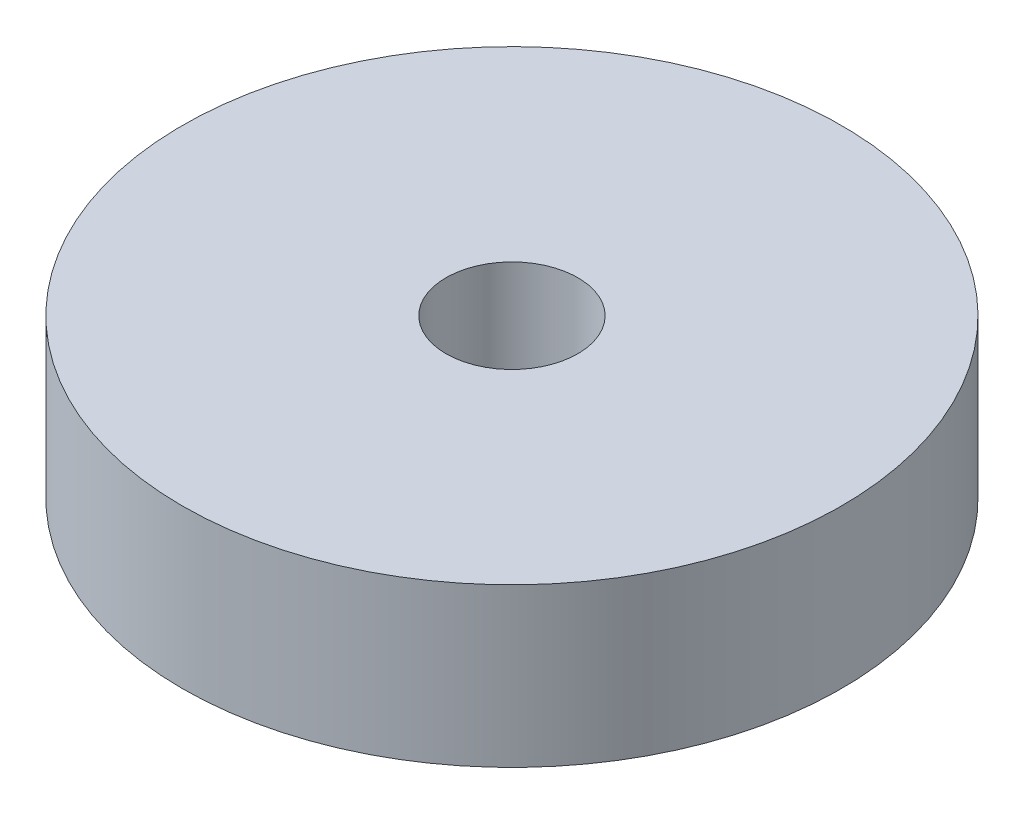
ISO-10303-21;
HEADER;
FILE_DESCRIPTION(('STEP AP214'),'2;1');
FILE_NAME('part.step','',(''),(''),'','','');
FILE_SCHEMA(('AUTOMOTIVE_DESIGN { 1 0 10303 214 1 1 1 1 }'));
ENDSEC;
DATA;
#1=APPLICATION_CONTEXT('core data for automotive mechanical design processes');
#2=APPLICATION_PROTOCOL_DEFINITION('international standard','automotive_design',2000,#1);
#3=PRODUCT_CONTEXT('',#1,'mechanical');
#4=PRODUCT('Part','Part','',(#3));
#5=PRODUCT_RELATED_PRODUCT_CATEGORY('part','',(#4));
#6=PRODUCT_DEFINITION_FORMATION('','',#4);
#7=PRODUCT_DEFINITION_CONTEXT('part definition',#1,'design');
#8=PRODUCT_DEFINITION('design','',#6,#7);
#9=PRODUCT_DEFINITION_SHAPE('','',#8);
#10=(LENGTH_UNIT() NAMED_UNIT(*) SI_UNIT(.MILLI.,.METRE.));
#11=(NAMED_UNIT(*) PLANE_ANGLE_UNIT() SI_UNIT($,.RADIAN.));
#12=(NAMED_UNIT(*) SI_UNIT($,.STERADIAN.) SOLID_ANGLE_UNIT());
#13=UNCERTAINTY_MEASURE_WITH_UNIT(LENGTH_MEASURE(1.E-05),#10,'distance_accuracy_value','');
#14=(GEOMETRIC_REPRESENTATION_CONTEXT(3) GLOBAL_UNCERTAINTY_ASSIGNED_CONTEXT((#13)) GLOBAL_UNIT_ASSIGNED_CONTEXT((#10,
#11,#12)) REPRESENTATION_CONTEXT('',''));
#15=CARTESIAN_POINT('',(0.,0.,0.));
#16=DIRECTION('',(0.,0.,1.));
#17=DIRECTION('',(1.,0.,0.));
#18=AXIS2_PLACEMENT_3D('',#15,#16,#17);
#19=CARTESIAN_POINT('',(0.,6.,0.));
#20=DIRECTION('',(0.,1.,0.));
#21=DIRECTION('',(0.,0.,1.));
#22=AXIS2_PLACEMENT_3D('',#19,#20,#21);
#23=PLANE('',#22);
#24=CARTESIAN_POINT('',(0.,6.,0.));
#25=DIRECTION('',(0.,1.,0.));
#26=DIRECTION('',(0.,0.,1.));
#27=AXIS2_PLACEMENT_3D('',#24,#25,#26);
#28=CIRCLE('',#27,12.5);
#29=CARTESIAN_POINT('',(0.,6.,12.5));
#30=VERTEX_POINT('',#29);
#31=EDGE_CURVE('E10',#30,#30,#28,.T.);
#32=ORIENTED_EDGE('',*,*,#31,.T.);
#33=EDGE_LOOP('',(#32));
#34=FACE_BOUND('',#33,.T.);
#35=CARTESIAN_POINT('',(0.,6.,0.));
#36=DIRECTION('',(0.,1.,0.));
#37=DIRECTION('',(0.,0.,1.));
#38=AXIS2_PLACEMENT_3D('',#35,#36,#37);
#39=CIRCLE('',#38,2.5);
#40=CARTESIAN_POINT('',(0.,6.,2.5));
#41=VERTEX_POINT('',#40);
#42=EDGE_CURVE('E50',#41,#41,#39,.T.);
#43=ORIENTED_EDGE('',*,*,#42,.F.);
#44=EDGE_LOOP('',(#43));
#45=FACE_BOUND('',#44,.T.);
#46=ADVANCED_FACE('F36',(#34,#45),#23,.T.);
#47=CARTESIAN_POINT('',(0.,0.,0.));
#48=DIRECTION('',(0.,1.,0.));
#49=DIRECTION('',(0.,0.,1.));
#50=AXIS2_PLACEMENT_3D('',#47,#48,#49);
#51=PLANE('',#50);
#52=CARTESIAN_POINT('',(0.,0.,0.));
#53=DIRECTION('',(0.,1.,0.));
#54=DIRECTION('',(0.,0.,1.));
#55=AXIS2_PLACEMENT_3D('',#52,#53,#54);
#56=CIRCLE('',#55,12.5);
#57=CARTESIAN_POINT('',(0.,0.,12.5));
#58=VERTEX_POINT('',#57);
#59=EDGE_CURVE('E40',#58,#58,#56,.T.);
#60=ORIENTED_EDGE('',*,*,#59,.F.);
#61=EDGE_LOOP('',(#60));
#62=FACE_BOUND('',#61,.T.);
#63=CARTESIAN_POINT('',(0.,0.,0.));
#64=DIRECTION('',(0.,1.,0.));
#65=DIRECTION('',(0.,0.,1.));
#66=AXIS2_PLACEMENT_3D('',#63,#64,#65);
#67=CIRCLE('',#66,2.5);
#68=CARTESIAN_POINT('',(0.,0.,2.5));
#69=VERTEX_POINT('',#68);
#70=EDGE_CURVE('E52',#69,#69,#67,.T.);
#71=ORIENTED_EDGE('',*,*,#70,.T.);
#72=EDGE_LOOP('',(#71));
#73=FACE_BOUND('',#72,.T.);
#74=ADVANCED_FACE('F63',(#62,#73),#51,.F.);
#75=CARTESIAN_POINT('',(0.,6.,0.));
#76=DIRECTION('',(0.,-1.,0.));
#77=DIRECTION('',(0.,0.,-1.));
#78=AXIS2_PLACEMENT_3D('',#75,#76,#77);
#79=CYLINDRICAL_SURFACE('',#78,12.5);
#80=ORIENTED_EDGE('',*,*,#31,.F.);
#81=EDGE_LOOP('',(#80));
#82=FACE_BOUND('',#81,.T.);
#83=ORIENTED_EDGE('',*,*,#59,.T.);
#84=EDGE_LOOP('',(#83));
#85=FACE_BOUND('',#84,.T.);
#86=ADVANCED_FACE('F38',(#82,#85),#79,.T.);
#87=CARTESIAN_POINT('',(0.,6.,0.));
#88=DIRECTION('',(0.,-1.,0.));
#89=DIRECTION('',(0.,0.,-1.));
#90=AXIS2_PLACEMENT_3D('',#87,#88,#89);
#91=CYLINDRICAL_SURFACE('',#90,2.5);
#92=ORIENTED_EDGE('',*,*,#42,.T.);
#93=EDGE_LOOP('',(#92));
#94=FACE_BOUND('',#93,.T.);
#95=ORIENTED_EDGE('',*,*,#70,.F.);
#96=EDGE_LOOP('',(#95));
#97=FACE_BOUND('',#96,.T.);
#98=ADVANCED_FACE('F59',(#94,#97),#91,.F.);
#99=CLOSED_SHELL('',(#46,#74,#86,#98));
#100=MANIFOLD_SOLID_BREP('B2',#99);
#101=ADVANCED_BREP_SHAPE_REPRESENTATION('',(#18,#100),#14);
#102=SHAPE_DEFINITION_REPRESENTATION(#9,#101);
ENDSEC;
END-ISO-10303-21;
